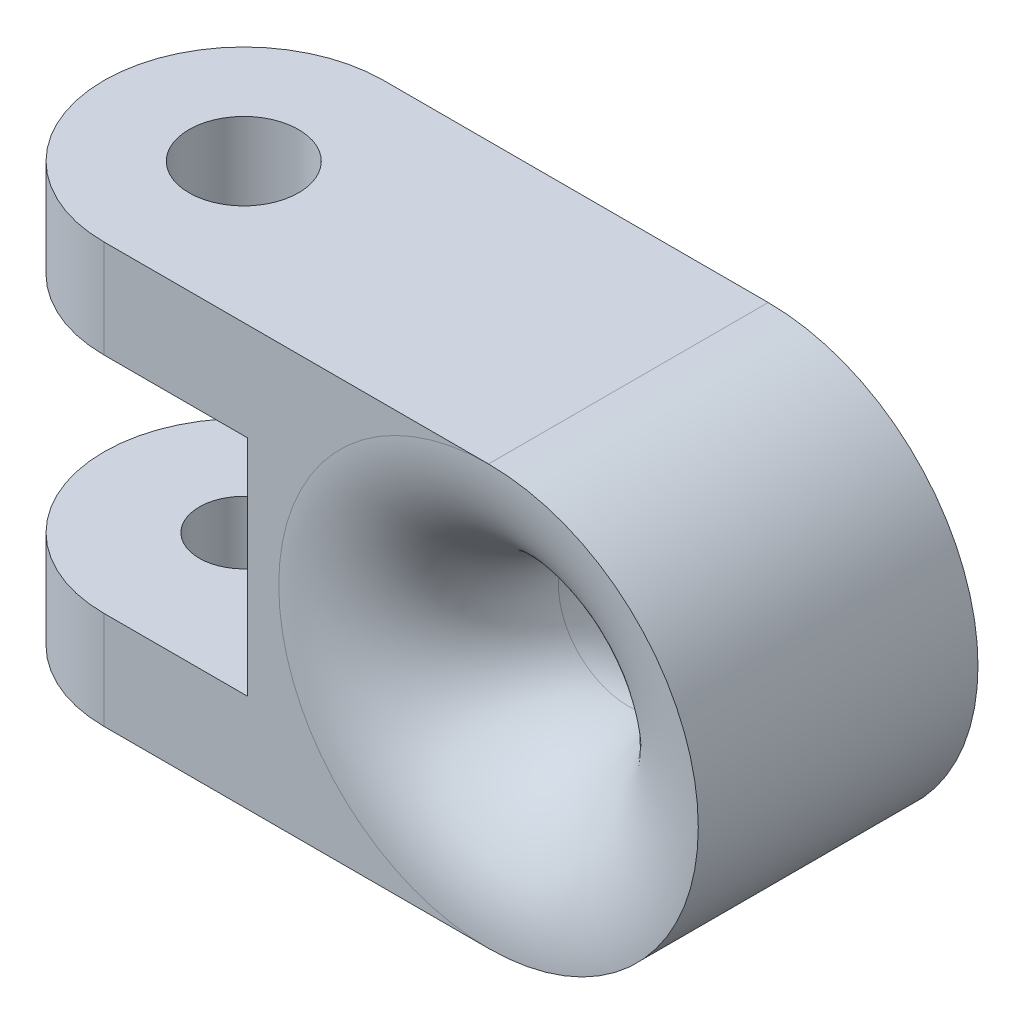
ISO-10303-21;
HEADER;
FILE_DESCRIPTION(('STEP AP214'),'2;1');
FILE_NAME('part.step','',(''),(''),'','','');
FILE_SCHEMA(('AUTOMOTIVE_DESIGN { 1 0 10303 214 1 1 1 1 }'));
ENDSEC;
DATA;
#1=APPLICATION_CONTEXT('core data for automotive mechanical design processes');
#2=APPLICATION_PROTOCOL_DEFINITION('international standard','automotive_design',2000,#1);
#3=PRODUCT_CONTEXT('',#1,'mechanical');
#4=PRODUCT('Part','Part','',(#3));
#5=PRODUCT_RELATED_PRODUCT_CATEGORY('part','',(#4));
#6=PRODUCT_DEFINITION_FORMATION('','',#4);
#7=PRODUCT_DEFINITION_CONTEXT('part definition',#1,'design');
#8=PRODUCT_DEFINITION('design','',#6,#7);
#9=PRODUCT_DEFINITION_SHAPE('','',#8);
#10=(LENGTH_UNIT() NAMED_UNIT(*) SI_UNIT(.MILLI.,.METRE.));
#11=(NAMED_UNIT(*) PLANE_ANGLE_UNIT() SI_UNIT($,.RADIAN.));
#12=(NAMED_UNIT(*) SI_UNIT($,.STERADIAN.) SOLID_ANGLE_UNIT());
#13=UNCERTAINTY_MEASURE_WITH_UNIT(LENGTH_MEASURE(1.E-05),#10,'distance_accuracy_value','');
#14=(GEOMETRIC_REPRESENTATION_CONTEXT(3) GLOBAL_UNCERTAINTY_ASSIGNED_CONTEXT((#13)) GLOBAL_UNIT_ASSIGNED_CONTEXT((#10,
#11,#12)) REPRESENTATION_CONTEXT('',''));
#15=CARTESIAN_POINT('',(0.,0.,0.));
#16=DIRECTION('',(0.,0.,1.));
#17=DIRECTION('',(1.,0.,0.));
#18=AXIS2_PLACEMENT_3D('',#15,#16,#17);
#19=CARTESIAN_POINT('',(0.,9.525,-6.35));
#20=DIRECTION('',(0.,0.,1.));
#21=DIRECTION('',(1.,0.,0.));
#22=AXIS2_PLACEMENT_3D('',#19,#20,#21);
#23=PLANE('',#22);
#24=DIRECTION('',(-1.,0.,0.));
#25=VECTOR('',#24,1.);
#26=CARTESIAN_POINT('',(0.,9.525,-6.35));
#27=LINE('',#26,#25);
#28=CARTESIAN_POINT('',(6.35,9.525,-6.35));
#29=VERTEX_POINT('',#28);
#30=CARTESIAN_POINT('',(-11.1125,9.525,-6.35));
#31=VERTEX_POINT('',#30);
#32=EDGE_CURVE('E105',#29,#31,#27,.T.);
#33=ORIENTED_EDGE('',*,*,#32,.F.);
#34=CARTESIAN_POINT('',(6.35,0.,-6.35));
#35=DIRECTION('',(0.,0.,1.));
#36=DIRECTION('',(1.,0.,0.));
#37=AXIS2_PLACEMENT_3D('',#34,#35,#36);
#38=CIRCLE('',#37,9.525);
#39=CARTESIAN_POINT('',(6.35,-9.525,-6.35));
#40=VERTEX_POINT('',#39);
#41=EDGE_CURVE('E11',#29,#40,#38,.T.);
#42=ORIENTED_EDGE('',*,*,#41,.T.);
#43=DIRECTION('',(-1.,0.,0.));
#44=VECTOR('',#43,1.);
#45=CARTESIAN_POINT('',(0.,-9.525,-6.35));
#46=LINE('',#45,#44);
#47=CARTESIAN_POINT('',(-11.1125,-9.525,-6.35));
#48=VERTEX_POINT('',#47);
#49=EDGE_CURVE('E99',#40,#48,#46,.T.);
#50=ORIENTED_EDGE('',*,*,#49,.T.);
#51=DIRECTION('',(0.,-1.,0.));
#52=VECTOR('',#51,1.);
#53=CARTESIAN_POINT('',(-11.1125,9.525,-6.35));
#54=LINE('',#53,#52);
#55=CARTESIAN_POINT('',(-11.1125,-5.08,-6.35));
#56=VERTEX_POINT('',#55);
#57=EDGE_CURVE('E95',#56,#48,#54,.T.);
#58=ORIENTED_EDGE('',*,*,#57,.F.);
#59=DIRECTION('',(-1.,0.,0.));
#60=VECTOR('',#59,1.);
#61=CARTESIAN_POINT('',(-4.588999966,-5.08,-6.35));
#62=LINE('',#61,#60);
#63=CARTESIAN_POINT('',(-4.588999966,-5.08,-6.35));
#64=VERTEX_POINT('',#63);
#65=EDGE_CURVE('E178',#64,#56,#62,.T.);
#66=ORIENTED_EDGE('',*,*,#65,.F.);
#67=DIRECTION('',(0.,1.,0.));
#68=VECTOR('',#67,1.);
#69=CARTESIAN_POINT('',(-4.588999966,-5.08,-6.35));
#70=LINE('',#69,#68);
#71=CARTESIAN_POINT('',(-4.588999966,5.08,-6.35));
#72=VERTEX_POINT('',#71);
#73=EDGE_CURVE('E139',#64,#72,#70,.T.);
#74=ORIENTED_EDGE('',*,*,#73,.T.);
#75=DIRECTION('',(-1.,0.,0.));
#76=VECTOR('',#75,1.);
#77=CARTESIAN_POINT('',(-4.588999966,5.08,-6.35));
#78=LINE('',#77,#76);
#79=CARTESIAN_POINT('',(-11.1125,5.08,-6.35));
#80=VERTEX_POINT('',#79);
#81=EDGE_CURVE('E179',#72,#80,#78,.T.);
#82=ORIENTED_EDGE('',*,*,#81,.T.);
#83=EDGE_CURVE('E111',#31,#80,#54,.T.);
#84=ORIENTED_EDGE('',*,*,#83,.F.);
#85=EDGE_LOOP('',(#33,#42,#50,#58,#66,#74,#82,#84));
#86=FACE_BOUND('',#85,.T.);
#87=ADVANCED_FACE('F35',(#86),#23,.F.);
#88=CARTESIAN_POINT('',(-11.1125,9.525,0.));
#89=DIRECTION('',(0.,-1.,0.));
#90=DIRECTION('',(0.,0.,-1.));
#91=AXIS2_PLACEMENT_3D('',#88,#89,#90);
#92=CYLINDRICAL_SURFACE('',#91,6.35);
#93=CARTESIAN_POINT('',(-11.1125,-5.08,0.));
#94=DIRECTION('',(0.,1.,0.));
#95=DIRECTION('',(0.,0.,1.));
#96=AXIS2_PLACEMENT_3D('',#93,#94,#95);
#97=CIRCLE('',#96,6.35);
#98=CARTESIAN_POINT('',(-11.1125,-5.08,6.35));
#99=VERTEX_POINT('',#98);
#100=EDGE_CURVE('E174',#56,#99,#97,.T.);
#101=ORIENTED_EDGE('',*,*,#100,.F.);
#102=ORIENTED_EDGE('',*,*,#57,.T.);
#103=CARTESIAN_POINT('',(-11.1125,-9.525,0.));
#104=DIRECTION('',(0.,1.,0.));
#105=DIRECTION('',(0.,0.,1.));
#106=AXIS2_PLACEMENT_3D('',#103,#104,#105);
#107=CIRCLE('',#106,6.35);
#108=CARTESIAN_POINT('',(-11.1125,-9.525,6.35));
#109=VERTEX_POINT('',#108);
#110=EDGE_CURVE('E92',#48,#109,#107,.T.);
#111=ORIENTED_EDGE('',*,*,#110,.T.);
#112=DIRECTION('',(0.,-1.,0.));
#113=VECTOR('',#112,1.);
#114=CARTESIAN_POINT('',(-11.1125,9.525,6.35));
#115=LINE('',#114,#113);
#116=EDGE_CURVE('E74',#99,#109,#115,.T.);
#117=ORIENTED_EDGE('',*,*,#116,.F.);
#118=EDGE_LOOP('',(#101,#102,#111,#117));
#119=FACE_BOUND('',#118,.T.);
#120=ADVANCED_FACE('F93',(#119),#92,.T.);
#121=CARTESIAN_POINT('',(0.,9.525,6.35));
#122=DIRECTION('',(0.,0.,-1.));
#123=DIRECTION('',(-1.,0.,0.));
#124=AXIS2_PLACEMENT_3D('',#121,#122,#123);
#125=PLANE('',#124);
#126=DIRECTION('',(1.,0.,0.));
#127=VECTOR('',#126,1.);
#128=CARTESIAN_POINT('',(0.,-9.525,6.35));
#129=LINE('',#128,#127);
#130=CARTESIAN_POINT('',(6.35,-9.525,6.35));
#131=VERTEX_POINT('',#130);
#132=EDGE_CURVE('E80',#109,#131,#129,.T.);
#133=ORIENTED_EDGE('',*,*,#132,.T.);
#134=CARTESIAN_POINT('',(6.35,0.,6.35));
#135=DIRECTION('',(0.,0.,-1.));
#136=DIRECTION('',(-1.,0.,0.));
#137=AXIS2_PLACEMENT_3D('',#134,#135,#136);
#138=CIRCLE('',#137,9.525);
#139=CARTESIAN_POINT('',(6.35,9.525,6.35));
#140=VERTEX_POINT('',#139);
#141=EDGE_CURVE('E44',#131,#140,#138,.T.);
#142=ORIENTED_EDGE('',*,*,#141,.T.);
#143=DIRECTION('',(1.,0.,0.));
#144=VECTOR('',#143,1.);
#145=CARTESIAN_POINT('',(0.,9.525,6.35));
#146=LINE('',#145,#144);
#147=CARTESIAN_POINT('',(-11.1125,9.525,6.35));
#148=VERTEX_POINT('',#147);
#149=EDGE_CURVE('E89',#148,#140,#146,.T.);
#150=ORIENTED_EDGE('',*,*,#149,.F.);
#151=CARTESIAN_POINT('',(-11.1125,5.08,6.35));
#152=VERTEX_POINT('',#151);
#153=EDGE_CURVE('E88',#148,#152,#115,.T.);
#154=ORIENTED_EDGE('',*,*,#153,.T.);
#155=DIRECTION('',(1.,0.,0.));
#156=VECTOR('',#155,1.);
#157=CARTESIAN_POINT('',(-11.1125,5.08,6.35));
#158=LINE('',#157,#156);
#159=CARTESIAN_POINT('',(-4.588999966,5.08,6.35));
#160=VERTEX_POINT('',#159);
#161=EDGE_CURVE('E194',#152,#160,#158,.T.);
#162=ORIENTED_EDGE('',*,*,#161,.T.);
#163=DIRECTION('',(0.,1.,0.));
#164=VECTOR('',#163,1.);
#165=CARTESIAN_POINT('',(-4.588999966,-5.08,6.35));
#166=LINE('',#165,#164);
#167=CARTESIAN_POINT('',(-4.588999966,-5.08,6.35));
#168=VERTEX_POINT('',#167);
#169=EDGE_CURVE('E143',#168,#160,#166,.T.);
#170=ORIENTED_EDGE('',*,*,#169,.F.);
#171=DIRECTION('',(1.,0.,0.));
#172=VECTOR('',#171,1.);
#173=CARTESIAN_POINT('',(-11.1125,-5.08,6.35));
#174=LINE('',#173,#172);
#175=EDGE_CURVE('E85',#99,#168,#174,.T.);
#176=ORIENTED_EDGE('',*,*,#175,.F.);
#177=ORIENTED_EDGE('',*,*,#116,.T.);
#178=EDGE_LOOP('',(#133,#142,#150,#154,#162,#170,#176,#177));
#179=FACE_BOUND('',#178,.T.);
#180=ADVANCED_FACE('F76',(#179),#125,.F.);
#181=ORIENTED_EDGE('',*,*,#83,.T.);
#182=CARTESIAN_POINT('',(-11.1125,5.08,0.));
#183=DIRECTION('',(0.,1.,0.));
#184=DIRECTION('',(0.,0.,1.));
#185=AXIS2_PLACEMENT_3D('',#182,#183,#184);
#186=CIRCLE('',#185,6.35);
#187=EDGE_CURVE('E191',#80,#152,#186,.T.);
#188=ORIENTED_EDGE('',*,*,#187,.T.);
#189=ORIENTED_EDGE('',*,*,#153,.F.);
#190=CARTESIAN_POINT('',(-11.1125,9.525,0.));
#191=DIRECTION('',(0.,1.,0.));
#192=DIRECTION('',(0.,0.,1.));
#193=AXIS2_PLACEMENT_3D('',#190,#191,#192);
#194=CIRCLE('',#193,6.35);
#195=EDGE_CURVE('E60',#31,#148,#194,.T.);
#196=ORIENTED_EDGE('',*,*,#195,.F.);
#197=EDGE_LOOP('',(#181,#188,#189,#196));
#198=FACE_BOUND('',#197,.T.);
#199=ADVANCED_FACE('F201',(#198),#92,.T.);
#200=CARTESIAN_POINT('',(-11.1125,9.525,0.));
#201=DIRECTION('',(0.,1.,0.));
#202=DIRECTION('',(0.,0.,1.));
#203=AXIS2_PLACEMENT_3D('',#200,#201,#202);
#204=PLANE('',#203);
#205=CARTESIAN_POINT('',(-11.1125,9.525,0.));
#206=DIRECTION('',(0.,1.,0.));
#207=DIRECTION('',(0.,0.,1.));
#208=AXIS2_PLACEMENT_3D('',#205,#206,#207);
#209=CIRCLE('',#208,2.48919999999999);
#210=CARTESIAN_POINT('',(-11.1125,9.525,2.48919999999999));
#211=VERTEX_POINT('',#210);
#212=EDGE_CURVE('E118',#211,#211,#209,.T.);
#213=ORIENTED_EDGE('',*,*,#212,.F.);
#214=EDGE_LOOP('',(#213));
#215=FACE_BOUND('',#214,.T.);
#216=ORIENTED_EDGE('',*,*,#149,.T.);
#217=DIRECTION('',(0.,0.,1.));
#218=VECTOR('',#217,1.);
#219=CARTESIAN_POINT('',(6.35,9.525,-38.1));
#220=LINE('',#219,#218);
#221=EDGE_CURVE('E129',#29,#140,#220,.T.);
#222=ORIENTED_EDGE('',*,*,#221,.F.);
#223=ORIENTED_EDGE('',*,*,#32,.T.);
#224=ORIENTED_EDGE('',*,*,#195,.T.);
#225=EDGE_LOOP('',(#216,#222,#223,#224));
#226=FACE_BOUND('',#225,.T.);
#227=ADVANCED_FACE('F128',(#215,#226),#204,.T.);
#228=CARTESIAN_POINT('',(-11.1125,-9.525,0.));
#229=DIRECTION('',(0.,1.,0.));
#230=DIRECTION('',(0.,0.,1.));
#231=AXIS2_PLACEMENT_3D('',#228,#229,#230);
#232=PLANE('',#231);
#233=CARTESIAN_POINT('',(-11.1125,-9.525,0.));
#234=DIRECTION('',(0.,1.,0.));
#235=DIRECTION('',(0.,0.,1.));
#236=AXIS2_PLACEMENT_3D('',#233,#234,#235);
#237=CIRCLE('',#236,2.0193);
#238=CARTESIAN_POINT('',(-11.1125,-9.525,2.0193));
#239=VERTEX_POINT('',#238);
#240=EDGE_CURVE('E186',#239,#239,#237,.T.);
#241=ORIENTED_EDGE('',*,*,#240,.T.);
#242=EDGE_LOOP('',(#241));
#243=FACE_BOUND('',#242,.T.);
#244=ORIENTED_EDGE('',*,*,#49,.F.);
#245=DIRECTION('',(0.,0.,1.));
#246=VECTOR('',#245,1.);
#247=CARTESIAN_POINT('',(6.35,-9.525,-38.1));
#248=LINE('',#247,#246);
#249=EDGE_CURVE('E103',#40,#131,#248,.T.);
#250=ORIENTED_EDGE('',*,*,#249,.T.);
#251=ORIENTED_EDGE('',*,*,#132,.F.);
#252=ORIENTED_EDGE('',*,*,#110,.F.);
#253=EDGE_LOOP('',(#244,#250,#251,#252));
#254=FACE_BOUND('',#253,.T.);
#255=ADVANCED_FACE('F101',(#243,#254),#232,.F.);
#256=CARTESIAN_POINT('',(6.35,0.,-38.1));
#257=DIRECTION('',(0.,0.,1.));
#258=DIRECTION('',(1.,0.,0.));
#259=AXIS2_PLACEMENT_3D('',#256,#257,#258);
#260=CYLINDRICAL_SURFACE('',#259,9.525);
#261=CARTESIAN_POINT('',(6.35,0.,-6.35));
#262=DIRECTION('',(0.,0.,1.));
#263=DIRECTION('',(1.,0.,0.));
#264=AXIS2_PLACEMENT_3D('',#261,#262,#263);
#265=CIRCLE('',#264,9.525);
#266=EDGE_CURVE('E136',#29,#40,#265,.F.);
#267=ORIENTED_EDGE('',*,*,#266,.F.);
#268=ORIENTED_EDGE('',*,*,#221,.T.);
#269=CARTESIAN_POINT('',(6.35,0.,6.35));
#270=DIRECTION('',(0.,0.,1.));
#271=DIRECTION('',(1.,0.,0.));
#272=AXIS2_PLACEMENT_3D('',#269,#270,#271);
#273=CIRCLE('',#272,9.525);
#274=EDGE_CURVE('E134',#131,#140,#273,.T.);
#275=ORIENTED_EDGE('',*,*,#274,.F.);
#276=ORIENTED_EDGE('',*,*,#249,.F.);
#277=EDGE_LOOP('',(#267,#268,#275,#276));
#278=FACE_BOUND('',#277,.T.);
#279=ADVANCED_FACE('F133',(#278),#260,.T.);
#280=CARTESIAN_POINT('',(-4.588999966,-5.08,6.35));
#281=DIRECTION('',(1.,0.,0.));
#282=DIRECTION('',(0.,0.,-1.));
#283=AXIS2_PLACEMENT_3D('',#280,#281,#282);
#284=PLANE('',#283);
#285=DIRECTION('',(0.,0.,-1.));
#286=VECTOR('',#285,1.);
#287=CARTESIAN_POINT('',(-4.588999966,5.08,6.35));
#288=LINE('',#287,#286);
#289=EDGE_CURVE('E51',#160,#72,#288,.T.);
#290=ORIENTED_EDGE('',*,*,#289,.T.);
#291=ORIENTED_EDGE('',*,*,#73,.F.);
#292=DIRECTION('',(0.,0.,-1.));
#293=VECTOR('',#292,1.);
#294=CARTESIAN_POINT('',(-4.588999966,-5.08,6.35));
#295=LINE('',#294,#293);
#296=EDGE_CURVE('E181',#168,#64,#295,.T.);
#297=ORIENTED_EDGE('',*,*,#296,.F.);
#298=ORIENTED_EDGE('',*,*,#169,.T.);
#299=EDGE_LOOP('',(#290,#291,#297,#298));
#300=FACE_BOUND('',#299,.T.);
#301=ADVANCED_FACE('F198',(#300),#284,.F.);
#302=CARTESIAN_POINT('',(-11.1125,-5.08,0.));
#303=DIRECTION('',(0.,1.,0.));
#304=DIRECTION('',(0.,0.,1.));
#305=AXIS2_PLACEMENT_3D('',#302,#303,#304);
#306=PLANE('',#305);
#307=CARTESIAN_POINT('',(-11.1125,-5.08,0.));
#308=DIRECTION('',(0.,1.,0.));
#309=DIRECTION('',(0.,0.,1.));
#310=AXIS2_PLACEMENT_3D('',#307,#308,#309);
#311=CIRCLE('',#310,2.01929999999999);
#312=CARTESIAN_POINT('',(-11.1125,-5.08,2.01929999999999));
#313=VERTEX_POINT('',#312);
#314=EDGE_CURVE('E117',#313,#313,#311,.T.);
#315=ORIENTED_EDGE('',*,*,#314,.F.);
#316=EDGE_LOOP('',(#315));
#317=FACE_BOUND('',#316,.T.);
#318=ORIENTED_EDGE('',*,*,#100,.T.);
#319=ORIENTED_EDGE('',*,*,#175,.T.);
#320=ORIENTED_EDGE('',*,*,#296,.T.);
#321=ORIENTED_EDGE('',*,*,#65,.T.);
#322=EDGE_LOOP('',(#318,#319,#320,#321));
#323=FACE_BOUND('',#322,.T.);
#324=ADVANCED_FACE('F175',(#317,#323),#306,.T.);
#325=CARTESIAN_POINT('',(-11.1125,5.08,0.));
#326=DIRECTION('',(0.,1.,0.));
#327=DIRECTION('',(0.,0.,1.));
#328=AXIS2_PLACEMENT_3D('',#325,#326,#327);
#329=PLANE('',#328);
#330=CARTESIAN_POINT('',(-11.1125,5.08,0.));
#331=DIRECTION('',(0.,1.,0.));
#332=DIRECTION('',(0.,0.,1.));
#333=AXIS2_PLACEMENT_3D('',#330,#331,#332);
#334=CIRCLE('',#333,2.48919999999999);
#335=CARTESIAN_POINT('',(-11.1125,5.08,2.48919999999999));
#336=VERTEX_POINT('',#335);
#337=EDGE_CURVE('E114',#336,#336,#334,.T.);
#338=ORIENTED_EDGE('',*,*,#337,.T.);
#339=EDGE_LOOP('',(#338));
#340=FACE_BOUND('',#339,.T.);
#341=ORIENTED_EDGE('',*,*,#187,.F.);
#342=ORIENTED_EDGE('',*,*,#81,.F.);
#343=ORIENTED_EDGE('',*,*,#289,.F.);
#344=ORIENTED_EDGE('',*,*,#161,.F.);
#345=EDGE_LOOP('',(#341,#342,#343,#344));
#346=FACE_BOUND('',#345,.T.);
#347=ADVANCED_FACE('F199',(#340,#346),#329,.F.);
#348=CARTESIAN_POINT('',(-11.1125,-5.08,0.));
#349=DIRECTION('',(0.,1.,0.));
#350=DIRECTION('',(0.,0.,1.));
#351=AXIS2_PLACEMENT_3D('',#348,#349,#350);
#352=CYLINDRICAL_SURFACE('',#351,2.01929999999999);
#353=ORIENTED_EDGE('',*,*,#240,.F.);
#354=EDGE_LOOP('',(#353));
#355=FACE_BOUND('',#354,.T.);
#356=ORIENTED_EDGE('',*,*,#314,.T.);
#357=EDGE_LOOP('',(#356));
#358=FACE_BOUND('',#357,.T.);
#359=ADVANCED_FACE('F229',(#355,#358),#352,.F.);
#360=CARTESIAN_POINT('',(-11.1125,9.525,0.));
#361=DIRECTION('',(0.,1.,0.));
#362=DIRECTION('',(0.,0.,1.));
#363=AXIS2_PLACEMENT_3D('',#360,#361,#362);
#364=CYLINDRICAL_SURFACE('',#363,2.48919999999999);
#365=ORIENTED_EDGE('',*,*,#212,.T.);
#366=EDGE_LOOP('',(#365));
#367=FACE_BOUND('',#366,.T.);
#368=ORIENTED_EDGE('',*,*,#337,.F.);
#369=EDGE_LOOP('',(#368));
#370=FACE_BOUND('',#369,.T.);
#371=ADVANCED_FACE('F215',(#367,#370),#364,.F.);
#372=CARTESIAN_POINT('',(6.35,0.,0.));
#373=DIRECTION('',(0.,0.,1.));
#374=DIRECTION('',(1.,0.,0.));
#375=AXIS2_PLACEMENT_3D('',#372,#373,#374);
#376=TOROIDAL_SURFACE('',#375,9.525,6.35);
#377=ORIENTED_EDGE('',*,*,#41,.F.);
#378=ORIENTED_EDGE('',*,*,#266,.T.);
#379=EDGE_LOOP('',(#377,#378));
#380=FACE_BOUND('',#379,.T.);
#381=CARTESIAN_POINT('',(6.35,0.,0.));
#382=DIRECTION('',(0.,0.,1.));
#383=DIRECTION('',(1.,0.,0.));
#384=AXIS2_PLACEMENT_3D('',#381,#382,#383);
#385=CIRCLE('',#384,3.175);
#386=CARTESIAN_POINT('',(9.525,0.,0.));
#387=VERTEX_POINT('',#386);
#388=EDGE_CURVE('E39',#387,#387,#385,.F.);
#389=ORIENTED_EDGE('',*,*,#388,.F.);
#390=EDGE_LOOP('',(#389));
#391=FACE_BOUND('',#390,.T.);
#392=ADVANCED_FACE('F37',(#380,#391),#376,.T.);
#393=CARTESIAN_POINT('',(6.35,0.,0.));
#394=DIRECTION('',(0.,0.,-1.));
#395=DIRECTION('',(-1.,0.,0.));
#396=AXIS2_PLACEMENT_3D('',#393,#394,#395);
#397=TOROIDAL_SURFACE('',#396,9.525,6.35);
#398=ORIENTED_EDGE('',*,*,#388,.T.);
#399=EDGE_LOOP('',(#398));
#400=FACE_BOUND('',#399,.T.);
#401=ORIENTED_EDGE('',*,*,#141,.F.);
#402=ORIENTED_EDGE('',*,*,#274,.T.);
#403=EDGE_LOOP('',(#401,#402));
#404=FACE_BOUND('',#403,.T.);
#405=ADVANCED_FACE('F138',(#400,#404),#397,.T.);
#406=CLOSED_SHELL('',(#87,#120,#180,#199,#227,#255,#279,#301,#324,#347,#359,#371,#392,#405));
#407=MANIFOLD_SOLID_BREP('B2',#406);
#408=ADVANCED_BREP_SHAPE_REPRESENTATION('',(#18,#407),#14);
#409=SHAPE_DEFINITION_REPRESENTATION(#9,#408);
ENDSEC;
END-ISO-10303-21;
